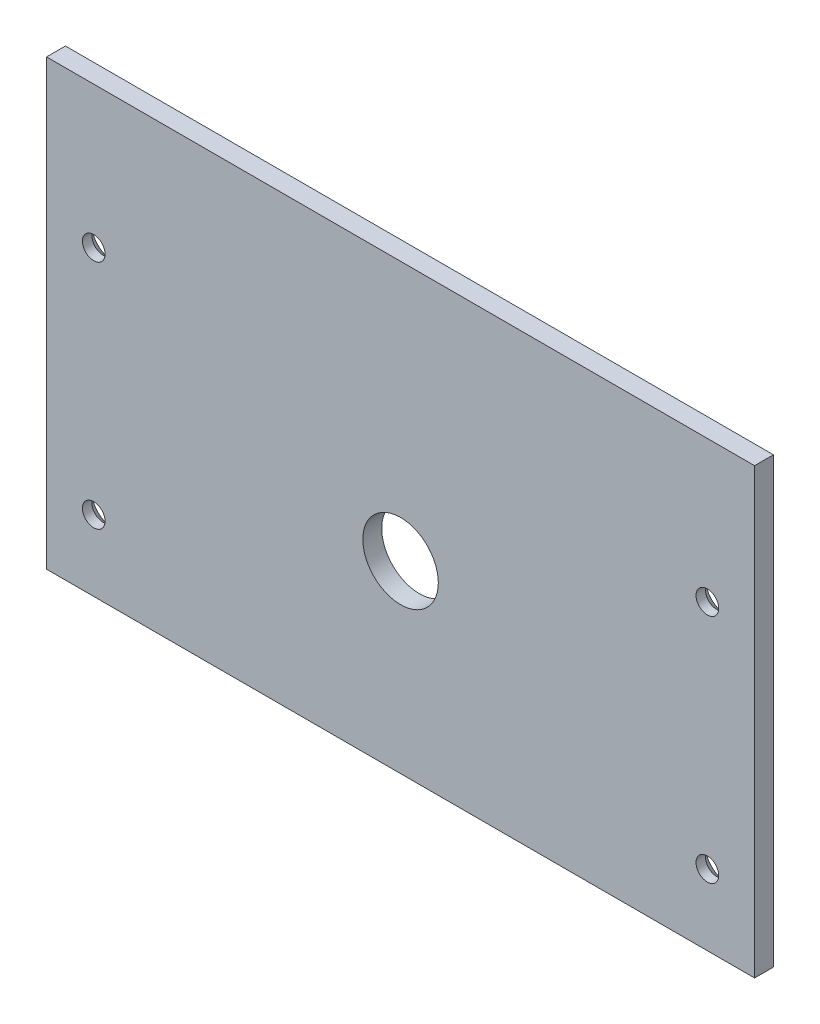
ISO-10303-21;
HEADER;
FILE_DESCRIPTION(('STEP AP214'),'2;1');
FILE_NAME('part.step','',(''),(''),'','','');
FILE_SCHEMA(('AUTOMOTIVE_DESIGN { 1 0 10303 214 1 1 1 1 }'));
ENDSEC;
DATA;
#1=APPLICATION_CONTEXT('core data for automotive mechanical design processes');
#2=APPLICATION_PROTOCOL_DEFINITION('international standard','automotive_design',2000,#1);
#3=PRODUCT_CONTEXT('',#1,'mechanical');
#4=PRODUCT('Part','Part','',(#3));
#5=PRODUCT_RELATED_PRODUCT_CATEGORY('part','',(#4));
#6=PRODUCT_DEFINITION_FORMATION('','',#4);
#7=PRODUCT_DEFINITION_CONTEXT('part definition',#1,'design');
#8=PRODUCT_DEFINITION('design','',#6,#7);
#9=PRODUCT_DEFINITION_SHAPE('','',#8);
#10=(LENGTH_UNIT() NAMED_UNIT(*) SI_UNIT(.MILLI.,.METRE.));
#11=(NAMED_UNIT(*) PLANE_ANGLE_UNIT() SI_UNIT($,.RADIAN.));
#12=(NAMED_UNIT(*) SI_UNIT($,.STERADIAN.) SOLID_ANGLE_UNIT());
#13=UNCERTAINTY_MEASURE_WITH_UNIT(LENGTH_MEASURE(1.E-05),#10,'distance_accuracy_value','');
#14=(GEOMETRIC_REPRESENTATION_CONTEXT(3) GLOBAL_UNCERTAINTY_ASSIGNED_CONTEXT((#13)) GLOBAL_UNIT_ASSIGNED_CONTEXT((#10,
#11,#12)) REPRESENTATION_CONTEXT('',''));
#15=CARTESIAN_POINT('',(0.,0.,0.));
#16=DIRECTION('',(0.,0.,1.));
#17=DIRECTION('',(1.,0.,0.));
#18=AXIS2_PLACEMENT_3D('',#15,#16,#17);
#19=CARTESIAN_POINT('',(37.5,23.5,2.));
#20=DIRECTION('',(-1.,0.,0.));
#21=DIRECTION('',(0.,-1.,0.));
#22=AXIS2_PLACEMENT_3D('',#19,#20,#21);
#23=PLANE('',#22);
#24=DIRECTION('',(0.,1.,0.));
#25=VECTOR('',#24,1.);
#26=CARTESIAN_POINT('',(37.5,23.5,0.));
#27=LINE('',#26,#25);
#28=CARTESIAN_POINT('',(37.5,-23.5,0.));
#29=VERTEX_POINT('',#28);
#30=CARTESIAN_POINT('',(37.5,23.5,0.));
#31=VERTEX_POINT('',#30);
#32=EDGE_CURVE('E97',#29,#31,#27,.T.);
#33=ORIENTED_EDGE('',*,*,#32,.T.);
#34=DIRECTION('',(0.,0.,-1.));
#35=VECTOR('',#34,1.);
#36=CARTESIAN_POINT('',(37.5,23.5,2.));
#37=LINE('',#36,#35);
#38=CARTESIAN_POINT('',(37.5,23.5,2.));
#39=VERTEX_POINT('',#38);
#40=EDGE_CURVE('E11',#39,#31,#37,.T.);
#41=ORIENTED_EDGE('',*,*,#40,.F.);
#42=DIRECTION('',(0.,1.,0.));
#43=VECTOR('',#42,1.);
#44=CARTESIAN_POINT('',(37.5,23.5,2.));
#45=LINE('',#44,#43);
#46=CARTESIAN_POINT('',(37.5,-23.5,2.));
#47=VERTEX_POINT('',#46);
#48=EDGE_CURVE('E84',#47,#39,#45,.T.);
#49=ORIENTED_EDGE('',*,*,#48,.F.);
#50=DIRECTION('',(0.,0.,-1.));
#51=VECTOR('',#50,1.);
#52=CARTESIAN_POINT('',(37.5,-23.5,2.));
#53=LINE('',#52,#51);
#54=EDGE_CURVE('E93',#47,#29,#53,.T.);
#55=ORIENTED_EDGE('',*,*,#54,.T.);
#56=EDGE_LOOP('',(#33,#41,#49,#55));
#57=FACE_BOUND('',#56,.T.);
#58=ADVANCED_FACE('F32',(#57),#23,.F.);
#59=CARTESIAN_POINT('',(-37.5,23.5,2.));
#60=DIRECTION('',(0.,-1.,0.));
#61=DIRECTION('',(0.,0.,-1.));
#62=AXIS2_PLACEMENT_3D('',#59,#60,#61);
#63=PLANE('',#62);
#64=DIRECTION('',(-1.,0.,0.));
#65=VECTOR('',#64,1.);
#66=CARTESIAN_POINT('',(-37.5,23.5,0.));
#67=LINE('',#66,#65);
#68=CARTESIAN_POINT('',(-37.5,23.5,0.));
#69=VERTEX_POINT('',#68);
#70=EDGE_CURVE('E88',#31,#69,#67,.T.);
#71=ORIENTED_EDGE('',*,*,#70,.T.);
#72=DIRECTION('',(0.,0.,-1.));
#73=VECTOR('',#72,1.);
#74=CARTESIAN_POINT('',(-37.5,23.5,2.));
#75=LINE('',#74,#73);
#76=CARTESIAN_POINT('',(-37.5,23.5,2.));
#77=VERTEX_POINT('',#76);
#78=EDGE_CURVE('E41',#77,#69,#75,.T.);
#79=ORIENTED_EDGE('',*,*,#78,.F.);
#80=DIRECTION('',(-1.,0.,0.));
#81=VECTOR('',#80,1.);
#82=CARTESIAN_POINT('',(-37.5,23.5,2.));
#83=LINE('',#82,#81);
#84=EDGE_CURVE('E79',#39,#77,#83,.T.);
#85=ORIENTED_EDGE('',*,*,#84,.F.);
#86=ORIENTED_EDGE('',*,*,#40,.T.);
#87=EDGE_LOOP('',(#71,#79,#85,#86));
#88=FACE_BOUND('',#87,.T.);
#89=ADVANCED_FACE('F87',(#88),#63,.F.);
#90=CARTESIAN_POINT('',(-37.5,23.5,2.));
#91=DIRECTION('',(1.,0.,0.));
#92=DIRECTION('',(0.,0.,-1.));
#93=AXIS2_PLACEMENT_3D('',#90,#91,#92);
#94=PLANE('',#93);
#95=DIRECTION('',(0.,-1.,0.));
#96=VECTOR('',#95,1.);
#97=CARTESIAN_POINT('',(-37.5,23.5,0.));
#98=LINE('',#97,#96);
#99=CARTESIAN_POINT('',(-37.5,-23.5,0.));
#100=VERTEX_POINT('',#99);
#101=EDGE_CURVE('E66',#69,#100,#98,.T.);
#102=ORIENTED_EDGE('',*,*,#101,.T.);
#103=DIRECTION('',(0.,0.,-1.));
#104=VECTOR('',#103,1.);
#105=CARTESIAN_POINT('',(-37.5,-23.5,2.));
#106=LINE('',#105,#104);
#107=CARTESIAN_POINT('',(-37.5,-23.5,2.));
#108=VERTEX_POINT('',#107);
#109=EDGE_CURVE('E89',#108,#100,#106,.T.);
#110=ORIENTED_EDGE('',*,*,#109,.F.);
#111=DIRECTION('',(0.,-1.,0.));
#112=VECTOR('',#111,1.);
#113=CARTESIAN_POINT('',(-37.5,23.5,2.));
#114=LINE('',#113,#112);
#115=EDGE_CURVE('E82',#77,#108,#114,.T.);
#116=ORIENTED_EDGE('',*,*,#115,.F.);
#117=ORIENTED_EDGE('',*,*,#78,.T.);
#118=EDGE_LOOP('',(#102,#110,#116,#117));
#119=FACE_BOUND('',#118,.T.);
#120=ADVANCED_FACE('F91',(#119),#94,.F.);
#121=CARTESIAN_POINT('',(-37.5,-23.5,2.));
#122=DIRECTION('',(0.,1.,0.));
#123=DIRECTION('',(0.,0.,1.));
#124=AXIS2_PLACEMENT_3D('',#121,#122,#123);
#125=PLANE('',#124);
#126=DIRECTION('',(1.,0.,0.));
#127=VECTOR('',#126,1.);
#128=CARTESIAN_POINT('',(-37.5,-23.5,0.));
#129=LINE('',#128,#127);
#130=EDGE_CURVE('E72',#100,#29,#129,.T.);
#131=ORIENTED_EDGE('',*,*,#130,.T.);
#132=ORIENTED_EDGE('',*,*,#54,.F.);
#133=DIRECTION('',(1.,0.,0.));
#134=VECTOR('',#133,1.);
#135=CARTESIAN_POINT('',(-37.5,-23.5,2.));
#136=LINE('',#135,#134);
#137=EDGE_CURVE('E49',#108,#47,#136,.T.);
#138=ORIENTED_EDGE('',*,*,#137,.F.);
#139=ORIENTED_EDGE('',*,*,#109,.T.);
#140=EDGE_LOOP('',(#131,#132,#138,#139));
#141=FACE_BOUND('',#140,.T.);
#142=ADVANCED_FACE('F104',(#141),#125,.F.);
#143=CARTESIAN_POINT('',(37.5,-23.5,2.));
#144=DIRECTION('',(0.,0.,1.));
#145=DIRECTION('',(1.,0.,0.));
#146=AXIS2_PLACEMENT_3D('',#143,#144,#145);
#147=PLANE('',#146);
#148=CARTESIAN_POINT('',(32.5,8.5,2.));
#149=DIRECTION('',(0.,0.,-1.));
#150=DIRECTION('',(-1.,0.,0.));
#151=AXIS2_PLACEMENT_3D('',#148,#149,#150);
#152=CIRCLE('',#151,1.19999999999999);
#153=CARTESIAN_POINT('',(31.3,8.5,2.));
#154=VERTEX_POINT('',#153);
#155=EDGE_CURVE('E140',#154,#154,#152,.T.);
#156=ORIENTED_EDGE('',*,*,#155,.T.);
#157=EDGE_LOOP('',(#156));
#158=FACE_BOUND('',#157,.T.);
#159=CARTESIAN_POINT('',(32.5,-16.,2.));
#160=DIRECTION('',(0.,0.,-1.));
#161=DIRECTION('',(-1.,0.,0.));
#162=AXIS2_PLACEMENT_3D('',#159,#160,#161);
#163=CIRCLE('',#162,1.19999999999999);
#164=CARTESIAN_POINT('',(31.3,-16.,2.));
#165=VERTEX_POINT('',#164);
#166=EDGE_CURVE('E131',#165,#165,#163,.T.);
#167=ORIENTED_EDGE('',*,*,#166,.T.);
#168=EDGE_LOOP('',(#167));
#169=FACE_BOUND('',#168,.T.);
#170=CARTESIAN_POINT('',(-32.5,8.5,2.));
#171=DIRECTION('',(0.,0.,-1.));
#172=DIRECTION('',(-1.,0.,0.));
#173=AXIS2_PLACEMENT_3D('',#170,#171,#172);
#174=CIRCLE('',#173,1.19999999999999);
#175=CARTESIAN_POINT('',(-33.7,8.5,2.));
#176=VERTEX_POINT('',#175);
#177=EDGE_CURVE('E122',#176,#176,#174,.T.);
#178=ORIENTED_EDGE('',*,*,#177,.T.);
#179=EDGE_LOOP('',(#178));
#180=FACE_BOUND('',#179,.T.);
#181=CARTESIAN_POINT('',(-32.5,-16.,2.));
#182=DIRECTION('',(0.,0.,-1.));
#183=DIRECTION('',(-1.,0.,0.));
#184=AXIS2_PLACEMENT_3D('',#181,#182,#183);
#185=CIRCLE('',#184,1.19999999999999);
#186=CARTESIAN_POINT('',(-33.7,-16.,2.));
#187=VERTEX_POINT('',#186);
#188=EDGE_CURVE('E113',#187,#187,#185,.T.);
#189=ORIENTED_EDGE('',*,*,#188,.T.);
#190=EDGE_LOOP('',(#189));
#191=FACE_BOUND('',#190,.T.);
#192=CARTESIAN_POINT('',(0.,-4.,2.));
#193=DIRECTION('',(0.,0.,1.));
#194=DIRECTION('',(1.,0.,0.));
#195=AXIS2_PLACEMENT_3D('',#192,#193,#194);
#196=CIRCLE('',#195,4.);
#197=CARTESIAN_POINT('',(4.,-4.,2.));
#198=VERTEX_POINT('',#197);
#199=EDGE_CURVE('E110',#198,#198,#196,.T.);
#200=ORIENTED_EDGE('',*,*,#199,.F.);
#201=EDGE_LOOP('',(#200));
#202=FACE_BOUND('',#201,.T.);
#203=ORIENTED_EDGE('',*,*,#48,.T.);
#204=ORIENTED_EDGE('',*,*,#84,.T.);
#205=ORIENTED_EDGE('',*,*,#115,.T.);
#206=ORIENTED_EDGE('',*,*,#137,.T.);
#207=EDGE_LOOP('',(#203,#204,#205,#206));
#208=FACE_BOUND('',#207,.T.);
#209=ADVANCED_FACE('F80',(#158,#169,#180,#191,#202,#208),#147,.T.);
#210=CARTESIAN_POINT('',(37.5,-23.5,0.));
#211=DIRECTION('',(0.,0.,1.));
#212=DIRECTION('',(1.,0.,0.));
#213=AXIS2_PLACEMENT_3D('',#210,#211,#212);
#214=PLANE('',#213);
#215=CARTESIAN_POINT('',(32.5,8.5,0.));
#216=DIRECTION('',(0.,0.,-1.));
#217=DIRECTION('',(-1.,0.,0.));
#218=AXIS2_PLACEMENT_3D('',#215,#216,#217);
#219=CIRCLE('',#218,2.2);
#220=CARTESIAN_POINT('',(30.3,8.5,0.));
#221=VERTEX_POINT('',#220);
#222=EDGE_CURVE('E146',#221,#221,#219,.T.);
#223=ORIENTED_EDGE('',*,*,#222,.F.);
#224=EDGE_LOOP('',(#223));
#225=FACE_BOUND('',#224,.T.);
#226=CARTESIAN_POINT('',(32.5,-16.,0.));
#227=DIRECTION('',(0.,0.,-1.));
#228=DIRECTION('',(-1.,0.,0.));
#229=AXIS2_PLACEMENT_3D('',#226,#227,#228);
#230=CIRCLE('',#229,2.2);
#231=CARTESIAN_POINT('',(30.3,-16.,0.));
#232=VERTEX_POINT('',#231);
#233=EDGE_CURVE('E137',#232,#232,#230,.T.);
#234=ORIENTED_EDGE('',*,*,#233,.F.);
#235=EDGE_LOOP('',(#234));
#236=FACE_BOUND('',#235,.T.);
#237=CARTESIAN_POINT('',(-32.5,8.5,0.));
#238=DIRECTION('',(0.,0.,-1.));
#239=DIRECTION('',(-1.,0.,0.));
#240=AXIS2_PLACEMENT_3D('',#237,#238,#239);
#241=CIRCLE('',#240,2.2);
#242=CARTESIAN_POINT('',(-34.7,8.5,0.));
#243=VERTEX_POINT('',#242);
#244=EDGE_CURVE('E128',#243,#243,#241,.T.);
#245=ORIENTED_EDGE('',*,*,#244,.F.);
#246=EDGE_LOOP('',(#245));
#247=FACE_BOUND('',#246,.T.);
#248=CARTESIAN_POINT('',(-32.5,-16.,0.));
#249=DIRECTION('',(0.,0.,-1.));
#250=DIRECTION('',(-1.,0.,0.));
#251=AXIS2_PLACEMENT_3D('',#248,#249,#250);
#252=CIRCLE('',#251,2.2);
#253=CARTESIAN_POINT('',(-34.7,-16.,0.));
#254=VERTEX_POINT('',#253);
#255=EDGE_CURVE('E119',#254,#254,#252,.T.);
#256=ORIENTED_EDGE('',*,*,#255,.F.);
#257=EDGE_LOOP('',(#256));
#258=FACE_BOUND('',#257,.T.);
#259=CARTESIAN_POINT('',(0.,-4.,0.));
#260=DIRECTION('',(0.,0.,1.));
#261=DIRECTION('',(1.,0.,0.));
#262=AXIS2_PLACEMENT_3D('',#259,#260,#261);
#263=CIRCLE('',#262,4.);
#264=CARTESIAN_POINT('',(4.,-4.,0.));
#265=VERTEX_POINT('',#264);
#266=EDGE_CURVE('E35',#265,#265,#263,.T.);
#267=ORIENTED_EDGE('',*,*,#266,.T.);
#268=EDGE_LOOP('',(#267));
#269=FACE_BOUND('',#268,.T.);
#270=ORIENTED_EDGE('',*,*,#32,.F.);
#271=ORIENTED_EDGE('',*,*,#130,.F.);
#272=ORIENTED_EDGE('',*,*,#101,.F.);
#273=ORIENTED_EDGE('',*,*,#70,.F.);
#274=EDGE_LOOP('',(#270,#271,#272,#273));
#275=FACE_BOUND('',#274,.T.);
#276=ADVANCED_FACE('F107',(#225,#236,#247,#258,#269,#275),#214,.F.);
#277=CARTESIAN_POINT('',(0.,-4.,-3.));
#278=DIRECTION('',(0.,0.,1.));
#279=DIRECTION('',(1.,0.,0.));
#280=AXIS2_PLACEMENT_3D('',#277,#278,#279);
#281=CYLINDRICAL_SURFACE('',#280,4.);
#282=ORIENTED_EDGE('',*,*,#199,.T.);
#283=EDGE_LOOP('',(#282));
#284=FACE_BOUND('',#283,.T.);
#285=ORIENTED_EDGE('',*,*,#266,.F.);
#286=EDGE_LOOP('',(#285));
#287=FACE_BOUND('',#286,.T.);
#288=ADVANCED_FACE('F154',(#284,#287),#281,.F.);
#289=CARTESIAN_POINT('',(-32.5,-16.,0.));
#290=DIRECTION('',(0.,0.,-1.));
#291=DIRECTION('',(-1.,0.,0.));
#292=AXIS2_PLACEMENT_3D('',#289,#290,#291);
#293=CYLINDRICAL_SURFACE('',#292,1.19999999999999);
#294=ORIENTED_EDGE('',*,*,#188,.F.);
#295=EDGE_LOOP('',(#294));
#296=FACE_BOUND('',#295,.T.);
#297=CARTESIAN_POINT('',(-32.5,-16.,1.));
#298=DIRECTION('',(0.,0.,-1.));
#299=DIRECTION('',(-1.,0.,0.));
#300=AXIS2_PLACEMENT_3D('',#297,#298,#299);
#301=CIRCLE('',#300,1.2);
#302=CARTESIAN_POINT('',(-33.7,-16.,1.));
#303=VERTEX_POINT('',#302);
#304=EDGE_CURVE('E116',#303,#303,#301,.T.);
#305=ORIENTED_EDGE('',*,*,#304,.T.);
#306=EDGE_LOOP('',(#305));
#307=FACE_BOUND('',#306,.T.);
#308=ADVANCED_FACE('F166',(#296,#307),#293,.F.);
#309=CARTESIAN_POINT('',(-32.5,-16.,0.));
#310=DIRECTION('',(0.,0.,-1.));
#311=DIRECTION('',(-1.,0.,0.));
#312=AXIS2_PLACEMENT_3D('',#309,#310,#311);
#313=CONICAL_SURFACE('',#312,2.2,0.785398163397448);
#314=ORIENTED_EDGE('',*,*,#304,.F.);
#315=EDGE_LOOP('',(#314));
#316=FACE_BOUND('',#315,.T.);
#317=ORIENTED_EDGE('',*,*,#255,.T.);
#318=EDGE_LOOP('',(#317));
#319=FACE_BOUND('',#318,.T.);
#320=ADVANCED_FACE('F172',(#316,#319),#313,.F.);
#321=CARTESIAN_POINT('',(-32.5,8.5,0.));
#322=DIRECTION('',(0.,0.,-1.));
#323=DIRECTION('',(-1.,0.,0.));
#324=AXIS2_PLACEMENT_3D('',#321,#322,#323);
#325=CYLINDRICAL_SURFACE('',#324,1.19999999999999);
#326=ORIENTED_EDGE('',*,*,#177,.F.);
#327=EDGE_LOOP('',(#326));
#328=FACE_BOUND('',#327,.T.);
#329=CARTESIAN_POINT('',(-32.5,8.5,1.));
#330=DIRECTION('',(0.,0.,-1.));
#331=DIRECTION('',(-1.,0.,0.));
#332=AXIS2_PLACEMENT_3D('',#329,#330,#331);
#333=CIRCLE('',#332,1.2);
#334=CARTESIAN_POINT('',(-33.7,8.5,1.));
#335=VERTEX_POINT('',#334);
#336=EDGE_CURVE('E125',#335,#335,#333,.T.);
#337=ORIENTED_EDGE('',*,*,#336,.T.);
#338=EDGE_LOOP('',(#337));
#339=FACE_BOUND('',#338,.T.);
#340=ADVANCED_FACE('F204',(#328,#339),#325,.F.);
#341=CARTESIAN_POINT('',(-32.5,8.5,0.));
#342=DIRECTION('',(0.,0.,-1.));
#343=DIRECTION('',(-1.,0.,0.));
#344=AXIS2_PLACEMENT_3D('',#341,#342,#343);
#345=CONICAL_SURFACE('',#344,2.2,0.785398163397448);
#346=ORIENTED_EDGE('',*,*,#336,.F.);
#347=EDGE_LOOP('',(#346));
#348=FACE_BOUND('',#347,.T.);
#349=ORIENTED_EDGE('',*,*,#244,.T.);
#350=EDGE_LOOP('',(#349));
#351=FACE_BOUND('',#350,.T.);
#352=ADVANCED_FACE('F209',(#348,#351),#345,.F.);
#353=CARTESIAN_POINT('',(32.5,-16.,0.));
#354=DIRECTION('',(0.,0.,-1.));
#355=DIRECTION('',(-1.,0.,0.));
#356=AXIS2_PLACEMENT_3D('',#353,#354,#355);
#357=CYLINDRICAL_SURFACE('',#356,1.19999999999999);
#358=ORIENTED_EDGE('',*,*,#166,.F.);
#359=EDGE_LOOP('',(#358));
#360=FACE_BOUND('',#359,.T.);
#361=CARTESIAN_POINT('',(32.5,-16.,1.));
#362=DIRECTION('',(0.,0.,-1.));
#363=DIRECTION('',(-1.,0.,0.));
#364=AXIS2_PLACEMENT_3D('',#361,#362,#363);
#365=CIRCLE('',#364,1.2);
#366=CARTESIAN_POINT('',(31.3,-16.,1.));
#367=VERTEX_POINT('',#366);
#368=EDGE_CURVE('E134',#367,#367,#365,.T.);
#369=ORIENTED_EDGE('',*,*,#368,.T.);
#370=EDGE_LOOP('',(#369));
#371=FACE_BOUND('',#370,.T.);
#372=ADVANCED_FACE('F215',(#360,#371),#357,.F.);
#373=CARTESIAN_POINT('',(32.5,-16.,0.));
#374=DIRECTION('',(0.,0.,-1.));
#375=DIRECTION('',(-1.,0.,0.));
#376=AXIS2_PLACEMENT_3D('',#373,#374,#375);
#377=CONICAL_SURFACE('',#376,2.2,0.785398163397448);
#378=ORIENTED_EDGE('',*,*,#368,.F.);
#379=EDGE_LOOP('',(#378));
#380=FACE_BOUND('',#379,.T.);
#381=ORIENTED_EDGE('',*,*,#233,.T.);
#382=EDGE_LOOP('',(#381));
#383=FACE_BOUND('',#382,.T.);
#384=ADVANCED_FACE('F219',(#380,#383),#377,.F.);
#385=CARTESIAN_POINT('',(32.5,8.5,0.));
#386=DIRECTION('',(0.,0.,-1.));
#387=DIRECTION('',(-1.,0.,0.));
#388=AXIS2_PLACEMENT_3D('',#385,#386,#387);
#389=CYLINDRICAL_SURFACE('',#388,1.19999999999999);
#390=ORIENTED_EDGE('',*,*,#155,.F.);
#391=EDGE_LOOP('',(#390));
#392=FACE_BOUND('',#391,.T.);
#393=CARTESIAN_POINT('',(32.5,8.5,1.));
#394=DIRECTION('',(0.,0.,-1.));
#395=DIRECTION('',(-1.,0.,0.));
#396=AXIS2_PLACEMENT_3D('',#393,#394,#395);
#397=CIRCLE('',#396,1.2);
#398=CARTESIAN_POINT('',(31.3,8.5,1.));
#399=VERTEX_POINT('',#398);
#400=EDGE_CURVE('E143',#399,#399,#397,.T.);
#401=ORIENTED_EDGE('',*,*,#400,.T.);
#402=EDGE_LOOP('',(#401));
#403=FACE_BOUND('',#402,.T.);
#404=ADVANCED_FACE('F223',(#392,#403),#389,.F.);
#405=CARTESIAN_POINT('',(32.5,8.5,0.));
#406=DIRECTION('',(0.,0.,-1.));
#407=DIRECTION('',(-1.,0.,0.));
#408=AXIS2_PLACEMENT_3D('',#405,#406,#407);
#409=CONICAL_SURFACE('',#408,2.2,0.785398163397448);
#410=ORIENTED_EDGE('',*,*,#400,.F.);
#411=EDGE_LOOP('',(#410));
#412=FACE_BOUND('',#411,.T.);
#413=ORIENTED_EDGE('',*,*,#222,.T.);
#414=EDGE_LOOP('',(#413));
#415=FACE_BOUND('',#414,.T.);
#416=ADVANCED_FACE('F150',(#412,#415),#409,.F.);
#417=CLOSED_SHELL('',(#58,#89,#120,#142,#209,#276,#288,#308,#320,#340,#352,#372,#384,#404,#416));
#418=MANIFOLD_SOLID_BREP('B2',#417);
#419=ADVANCED_BREP_SHAPE_REPRESENTATION('',(#18,#418),#14);
#420=SHAPE_DEFINITION_REPRESENTATION(#9,#419);
ENDSEC;
END-ISO-10303-21;
